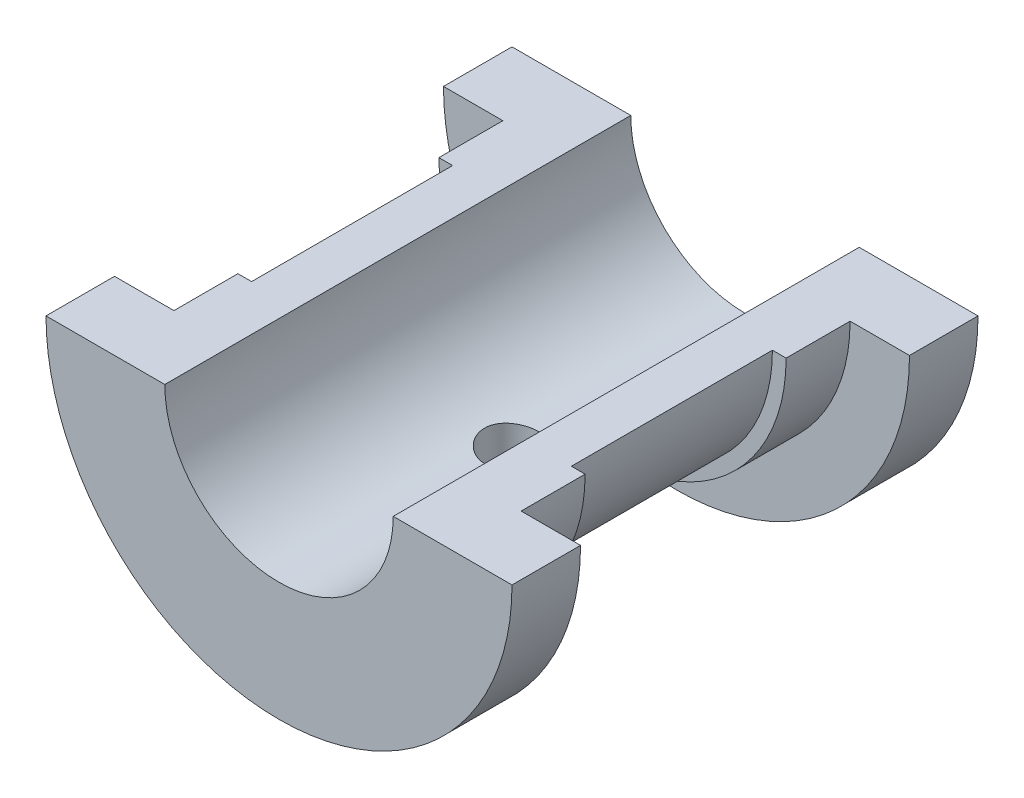
ISO-10303-21;
HEADER;
FILE_DESCRIPTION(('STEP AP214'),'2;1');
FILE_NAME('part.step','',(''),(''),'','','');
FILE_SCHEMA(('AUTOMOTIVE_DESIGN { 1 0 10303 214 1 1 1 1 }'));
ENDSEC;
DATA;
#1=APPLICATION_CONTEXT('core data for automotive mechanical design processes');
#2=APPLICATION_PROTOCOL_DEFINITION('international standard','automotive_design',2000,#1);
#3=PRODUCT_CONTEXT('',#1,'mechanical');
#4=PRODUCT('Part','Part','',(#3));
#5=PRODUCT_RELATED_PRODUCT_CATEGORY('part','',(#4));
#6=PRODUCT_DEFINITION_FORMATION('','',#4);
#7=PRODUCT_DEFINITION_CONTEXT('part definition',#1,'design');
#8=PRODUCT_DEFINITION('design','',#6,#7);
#9=PRODUCT_DEFINITION_SHAPE('','',#8);
#10=(LENGTH_UNIT() NAMED_UNIT(*) SI_UNIT(.MILLI.,.METRE.));
#11=(NAMED_UNIT(*) PLANE_ANGLE_UNIT() SI_UNIT($,.RADIAN.));
#12=(NAMED_UNIT(*) SI_UNIT($,.STERADIAN.) SOLID_ANGLE_UNIT());
#13=UNCERTAINTY_MEASURE_WITH_UNIT(LENGTH_MEASURE(1.E-05),#10,'distance_accuracy_value','');
#14=(GEOMETRIC_REPRESENTATION_CONTEXT(3) GLOBAL_UNCERTAINTY_ASSIGNED_CONTEXT((#13)) GLOBAL_UNIT_ASSIGNED_CONTEXT((#10,
#11,#12)) REPRESENTATION_CONTEXT('',''));
#15=CARTESIAN_POINT('',(0.,0.,0.));
#16=DIRECTION('',(0.,0.,1.));
#17=DIRECTION('',(1.,0.,0.));
#18=AXIS2_PLACEMENT_3D('',#15,#16,#17);
#19=CARTESIAN_POINT('',(25.5,1.78065548281E-13,-25.5));
#20=DIRECTION('',(0.,0.,-1.));
#21=DIRECTION('',(-1.,0.,0.));
#22=AXIS2_PLACEMENT_3D('',#19,#20,#21);
#23=PLANE('',#22);
#24=CARTESIAN_POINT('',(0.,0.,-25.5));
#25=DIRECTION('',(0.,0.,-1.));
#26=DIRECTION('',(-1.,0.,0.));
#27=AXIS2_PLACEMENT_3D('',#24,#25,#26);
#28=CIRCLE('',#27,12.5);
#29=CARTESIAN_POINT('',(12.5,0.,-25.5));
#30=VERTEX_POINT('',#29);
#31=CARTESIAN_POINT('',(-12.5,0.,-25.5));
#32=VERTEX_POINT('',#31);
#33=EDGE_CURVE('E46',#30,#32,#28,.T.);
#34=ORIENTED_EDGE('',*,*,#33,.F.);
#35=DIRECTION('',(1.,0.,0.));
#36=VECTOR('',#35,1.);
#37=CARTESIAN_POINT('',(25.5,1.78065548281E-13,-25.5));
#38=LINE('',#37,#36);
#39=CARTESIAN_POINT('',(25.5,1.78065548281E-13,-25.5));
#40=VERTEX_POINT('',#39);
#41=EDGE_CURVE('E129',#30,#40,#38,.T.);
#42=ORIENTED_EDGE('',*,*,#41,.T.);
#43=CARTESIAN_POINT('',(0.,0.,-25.5));
#44=DIRECTION('',(0.,0.,-1.));
#45=DIRECTION('',(-1.,0.,0.));
#46=AXIS2_PLACEMENT_3D('',#43,#44,#45);
#47=CIRCLE('',#46,25.5);
#48=CARTESIAN_POINT('',(-25.5,0.,-25.5));
#49=VERTEX_POINT('',#48);
#50=EDGE_CURVE('E124',#40,#49,#47,.T.);
#51=ORIENTED_EDGE('',*,*,#50,.T.);
#52=DIRECTION('',(-1.,0.,0.));
#53=VECTOR('',#52,1.);
#54=CARTESIAN_POINT('',(-25.5,0.,-25.5));
#55=LINE('',#54,#53);
#56=EDGE_CURVE('E127',#32,#49,#55,.T.);
#57=ORIENTED_EDGE('',*,*,#56,.F.);
#58=EDGE_LOOP('',(#34,#42,#51,#57));
#59=FACE_BOUND('',#58,.T.);
#60=ADVANCED_FACE('F33',(#59),#23,.T.);
#61=CARTESIAN_POINT('',(0.,0.,0.));
#62=DIRECTION('',(0.,0.,-1.));
#63=DIRECTION('',(-1.,0.,0.));
#64=AXIS2_PLACEMENT_3D('',#61,#62,#63);
#65=CYLINDRICAL_SURFACE('',#64,12.5);
#66=CARTESIAN_POINT('',(0.,-12.5,-3.));
#67=CARTESIAN_POINT('',(-0.165963929028716,-12.4999970714968,-2.99999497592273));
#68=CARTESIAN_POINT('',(-0.331985420928068,-12.4966615634859,-2.98618158976393));
#69=CARTESIAN_POINT('',(-0.65928429097138,-12.4836783946932,-2.93136726040462));
#70=CARTESIAN_POINT('',(-0.820558683214275,-12.4740268462166,-2.89034957200532));
#71=CARTESIAN_POINT('',(-1.13358839471402,-12.4494823208195,-2.78250766549564));
#72=CARTESIAN_POINT('',(-1.28535442324822,-12.4345953702841,-2.71571311014241));
#73=CARTESIAN_POINT('',(-1.57552517879763,-12.4011725442513,-2.55831456355411));
#74=CARTESIAN_POINT('',(-1.71392971475166,-12.3826366165873,-2.46771023192274));
#75=CARTESIAN_POINT('',(-1.97609263393972,-12.3435386014785,-2.26343582162447));
#76=CARTESIAN_POINT('',(-2.0995595210048,-12.322947245431,-2.14939721895074));
#77=CARTESIAN_POINT('',(-2.32581080811943,-12.2822574370147,-1.90228113093536));
#78=CARTESIAN_POINT('',(-2.42859304624489,-12.2621590363612,-1.76920165795905));
#79=CARTESIAN_POINT('',(-2.61189993555015,-12.224437969062,-1.48555416698254));
#80=CARTESIAN_POINT('',(-2.69210377047565,-12.2068525815312,-1.33477341624115));
#81=CARTESIAN_POINT('',(-2.82591582947333,-12.1765733412448,-1.02138016487152));
#82=CARTESIAN_POINT('',(-2.87952794169564,-12.1638787734309,-0.858769397976844));
#83=CARTESIAN_POINT('',(-2.95765058108663,-12.1451184675007,-0.529523426731097));
#84=CARTESIAN_POINT('',(-2.98268262400616,-12.1389341034343,-0.363018878474493));
#85=CARTESIAN_POINT('',(-3.00455808879087,-12.1335389605945,-0.0280676203572424));
#86=CARTESIAN_POINT('',(-3.00140571682399,-12.1343271412568,0.140378795956922));
#87=CARTESIAN_POINT('',(-2.96741912081942,-12.1426811387007,0.470475966012881));
#88=CARTESIAN_POINT('',(-2.93720103400494,-12.1500960921292,0.632194565189556));
#89=CARTESIAN_POINT('',(-2.85092141637189,-12.1706283738785,0.948197316647835));
#90=CARTESIAN_POINT('',(-2.79485817372027,-12.1837460799133,1.10248097573443));
#91=CARTESIAN_POINT('',(-2.65794121231782,-12.2143476734445,1.40091297808436));
#92=CARTESIAN_POINT('',(-2.5768594824696,-12.2318714325758,1.54495245291669));
#93=CARTESIAN_POINT('',(-2.39236688956383,-12.2692875046196,1.81760450072258));
#94=CARTESIAN_POINT('',(-2.28895240342647,-12.2891802016137,1.94621456528511));
#95=CARTESIAN_POINT('',(-2.05951493908847,-12.329732025739,2.18789357031874));
#96=CARTESIAN_POINT('',(-1.93297064389908,-12.3503975788014,2.30046709906221));
#97=CARTESIAN_POINT('',(-1.66255592459691,-12.3896951594929,2.50288471974638));
#98=CARTESIAN_POINT('',(-1.51868504982141,-12.4083271342048,2.59272822029261));
#99=CARTESIAN_POINT('',(-1.21702847718581,-12.4415394956921,2.74729722061278));
#100=CARTESIAN_POINT('',(-1.05920278696054,-12.4561077058019,2.81194745623779));
#101=CARTESIAN_POINT('',(-0.734497606078676,-12.4794620474154,2.91366507904859));
#102=CARTESIAN_POINT('',(-0.567619713387662,-12.4882491958651,2.95073731762681));
#103=CARTESIAN_POINT('',(-0.233787399651665,-12.4989027542708,2.99550206465204));
#104=CARTESIAN_POINT('',(-0.0669284805450078,-12.5009282130753,3.00386989246157));
#105=CARTESIAN_POINT('',(0.265804381586629,-12.4982807419474,2.9928332331491));
#106=CARTESIAN_POINT('',(0.431678404764952,-12.4936083648176,2.97343103801277));
#107=CARTESIAN_POINT('',(0.755422580108847,-12.4781916395217,2.90796302148362));
#108=CARTESIAN_POINT('',(0.913370579311303,-12.4675301590363,2.8622608904262));
#109=CARTESIAN_POINT('',(1.21935330013476,-12.4413335015664,2.74590180830474));
#110=CARTESIAN_POINT('',(1.3673870666415,-12.4257978558334,2.6752424570219));
#111=CARTESIAN_POINT('',(1.6520615099557,-12.3911910149582,2.50963340640215));
#112=CARTESIAN_POINT('',(1.78847176740355,-12.3720653178033,2.41429928307563));
#113=CARTESIAN_POINT('',(2.04359904096632,-12.3324936406987,2.20254307098659));
#114=CARTESIAN_POINT('',(2.16231325074336,-12.3120474520734,2.08611764391922));
#115=CARTESIAN_POINT('',(2.38142453789941,-12.271574214277,1.83235916879145));
#116=CARTESIAN_POINT('',(2.4813497404737,-12.2515669262668,1.6946148779179));
#117=CARTESIAN_POINT('',(2.65666020824081,-12.2147538797452,1.40390957210327));
#118=CARTESIAN_POINT('',(2.7320465722335,-12.1979479778962,1.25094923890653));
#119=CARTESIAN_POINT('',(2.85558993518171,-12.1696189519335,0.934987486456012));
#120=CARTESIAN_POINT('',(2.90390754385905,-12.1580647463107,0.772051796578773));
#121=CARTESIAN_POINT('',(2.97238380283979,-12.1415072663683,0.440053814979307));
#122=CARTESIAN_POINT('',(2.99254804274991,-12.1365026916888,0.270992746238226));
#123=CARTESIAN_POINT('',(3.00387066449353,-12.1337046220624,-0.0636707002805993));
#124=CARTESIAN_POINT('',(2.99578106592266,-12.1357241633848,-0.229246496326695));
#125=CARTESIAN_POINT('',(2.95253345626267,-12.1463176460425,-0.556599764223693));
#126=CARTESIAN_POINT('',(2.91737590900096,-12.1548914750658,-0.718377301111356));
#127=CARTESIAN_POINT('',(2.82138591303537,-12.1775274976747,-1.03279755254825));
#128=CARTESIAN_POINT('',(2.76068402045612,-12.191561756094,-1.18548227258375));
#129=CARTESIAN_POINT('',(2.61543373580582,-12.2235433612686,-1.47860441388369));
#130=CARTESIAN_POINT('',(2.53088229934855,-12.2414912075257,-1.61904026858636));
#131=CARTESIAN_POINT('',(2.33793007708464,-12.279819325529,-1.88733700011951));
#132=CARTESIAN_POINT('',(2.22900267979018,-12.3002478697532,-2.01481232309873));
#133=CARTESIAN_POINT('',(1.99143074773236,-12.3409359831145,-2.24991998805192));
#134=CARTESIAN_POINT('',(1.86278158874234,-12.361195511444,-2.35754766321024));
#135=CARTESIAN_POINT('',(1.5868829988014,-12.3996570299581,-2.55160925955475));
#136=CARTESIAN_POINT('',(1.43936414359402,-12.4178200201219,-2.637668405442));
#137=CARTESIAN_POINT('',(1.13153622828567,-12.4496380610582,-2.78362953274789));
#138=CARTESIAN_POINT('',(0.971236973691222,-12.4632965272855,-2.84355134339162));
#139=CARTESIAN_POINT('',(0.675887025694767,-12.4824059901497,-2.92603862513779));
#140=CARTESIAN_POINT('',(0.542312066268424,-12.4889599449579,-2.9537166157857));
#141=CARTESIAN_POINT('',(0.272504227478251,-12.4977580149525,-2.99069878085188));
#142=CARTESIAN_POINT('',(0.136271517915778,-12.5000024045682,-3.00000412522552));
#143=CARTESIAN_POINT('',(0.,-12.5,-3.));
#144=B_SPLINE_CURVE_WITH_KNOTS('',3,(#66,#67,#68,#69,#70,#71,#72,#73,#74,#75,#76,#77,#78,#79,
#80,#81,#82,#83,#84,#85,#86,#87,#88,#89,#90,#91,#92,#93,#94,#95,#96,#97,#98,#99,#100,#101,#102,
#103,#104,#105,#106,#107,#108,#109,#110,#111,#112,#113,#114,#115,#116,#117,#118,#119,#120,#121,
#122,#123,#124,#125,#126,#127,#128,#129,#130,#131,#132,#133,#134,#135,#136,#137,#138,#139,#140,
#141,#142,#143),.UNSPECIFIED.,.T.,.F.,(4,2,2,2,2,2,2,2,2,2,2,2,2,2,2,2,2,2,2,2,2,2,2,2,2,2,2,2,
2,2,2,2,2,2,2,2,2,2,4),(0.,0.497392599366678,0.995091645758824,1.49221966408501,
1.98935478998519,2.49500570148357,3.00070943533306,3.51327262050849,4.02576083835037,
4.52873995359111,5.03164400680465,5.52338274964838,6.01515406709138,6.51154667521171,
7.00801987450003,7.51749958381934,8.0269925475217,8.53799614678203,9.04890983140415,
9.54771776810825,10.0464845383097,10.5385143736981,11.0305915421211,11.5308523313794,
12.031192370573,12.5427824523192,13.0543496229377,13.5628484119093,14.0712462285018,
14.5662165454702,15.0611783809799,15.5536406351284,16.0461657803879,16.5505844610431,
17.0551215958269,17.5678974206352,18.0802835459069,18.4887142303991,18.897118905514),.UNSPECIFIED.);
#145=CARTESIAN_POINT('',(0.,-12.5,-3.));
#146=VERTEX_POINT('',#145);
#147=EDGE_CURVE('E148',#146,#146,#144,.T.);
#148=ORIENTED_EDGE('',*,*,#147,.F.);
#149=EDGE_LOOP('',(#148));
#150=FACE_BOUND('',#149,.T.);
#151=CARTESIAN_POINT('',(0.,0.,25.5));
#152=DIRECTION('',(0.,0.,-1.));
#153=DIRECTION('',(-1.,0.,0.));
#154=AXIS2_PLACEMENT_3D('',#151,#152,#153);
#155=CIRCLE('',#154,12.5);
#156=CARTESIAN_POINT('',(12.5,0.,25.5));
#157=VERTEX_POINT('',#156);
#158=CARTESIAN_POINT('',(-12.5,0.,25.5));
#159=VERTEX_POINT('',#158);
#160=EDGE_CURVE('E59',#157,#159,#155,.T.);
#161=ORIENTED_EDGE('',*,*,#160,.F.);
#162=DIRECTION('',(0.,0.,-1.));
#163=VECTOR('',#162,1.);
#164=CARTESIAN_POINT('',(12.5,0.,-25.5));
#165=LINE('',#164,#163);
#166=EDGE_CURVE('E134',#157,#30,#165,.T.);
#167=ORIENTED_EDGE('',*,*,#166,.T.);
#168=ORIENTED_EDGE('',*,*,#33,.T.);
#169=DIRECTION('',(0.,0.,-1.));
#170=VECTOR('',#169,1.);
#171=CARTESIAN_POINT('',(-12.5,0.,-25.5));
#172=LINE('',#171,#170);
#173=EDGE_CURVE('E147',#159,#32,#172,.T.);
#174=ORIENTED_EDGE('',*,*,#173,.F.);
#175=EDGE_LOOP('',(#161,#167,#168,#174));
#176=FACE_BOUND('',#175,.T.);
#177=ADVANCED_FACE('F35',(#150,#176),#65,.F.);
#178=CARTESIAN_POINT('',(25.5,1.78065548281E-13,25.5));
#179=DIRECTION('',(0.,0.,1.));
#180=DIRECTION('',(1.,0.,0.));
#181=AXIS2_PLACEMENT_3D('',#178,#179,#180);
#182=PLANE('',#181);
#183=CARTESIAN_POINT('',(0.,0.,25.5));
#184=DIRECTION('',(0.,0.,-1.));
#185=DIRECTION('',(-1.,0.,0.));
#186=AXIS2_PLACEMENT_3D('',#183,#184,#185);
#187=CIRCLE('',#186,25.5);
#188=CARTESIAN_POINT('',(25.5,1.78065548281E-13,25.5));
#189=VERTEX_POINT('',#188);
#190=CARTESIAN_POINT('',(-25.5,0.,25.5));
#191=VERTEX_POINT('',#190);
#192=EDGE_CURVE('E225',#189,#191,#187,.T.);
#193=ORIENTED_EDGE('',*,*,#192,.F.);
#194=DIRECTION('',(-1.,0.,0.));
#195=VECTOR('',#194,1.);
#196=CARTESIAN_POINT('',(25.5,1.78065548281E-13,25.5));
#197=LINE('',#196,#195);
#198=EDGE_CURVE('E207',#189,#157,#197,.T.);
#199=ORIENTED_EDGE('',*,*,#198,.T.);
#200=ORIENTED_EDGE('',*,*,#160,.T.);
#201=DIRECTION('',(1.,0.,0.));
#202=VECTOR('',#201,1.);
#203=CARTESIAN_POINT('',(-25.5,0.,25.5));
#204=LINE('',#203,#202);
#205=EDGE_CURVE('E177',#191,#159,#204,.T.);
#206=ORIENTED_EDGE('',*,*,#205,.F.);
#207=EDGE_LOOP('',(#193,#199,#200,#206));
#208=FACE_BOUND('',#207,.T.);
#209=ADVANCED_FACE('F264',(#208),#182,.T.);
#210=CARTESIAN_POINT('',(0.,0.,0.));
#211=DIRECTION('',(0.,0.,-1.));
#212=DIRECTION('',(-1.,0.,0.));
#213=AXIS2_PLACEMENT_3D('',#210,#211,#212);
#214=CYLINDRICAL_SURFACE('',#213,25.5);
#215=CARTESIAN_POINT('',(0.,0.,18.));
#216=DIRECTION('',(0.,0.,-1.));
#217=DIRECTION('',(-1.,0.,0.));
#218=AXIS2_PLACEMENT_3D('',#215,#216,#217);
#219=CIRCLE('',#218,25.5);
#220=CARTESIAN_POINT('',(25.5,1.78065548281E-13,18.));
#221=VERTEX_POINT('',#220);
#222=CARTESIAN_POINT('',(-25.5,0.,18.));
#223=VERTEX_POINT('',#222);
#224=EDGE_CURVE('E223',#221,#223,#219,.T.);
#225=ORIENTED_EDGE('',*,*,#224,.F.);
#226=DIRECTION('',(0.,0.,1.));
#227=VECTOR('',#226,1.);
#228=CARTESIAN_POINT('',(25.5,1.78065548281E-13,25.5));
#229=LINE('',#228,#227);
#230=EDGE_CURVE('E204',#221,#189,#229,.T.);
#231=ORIENTED_EDGE('',*,*,#230,.T.);
#232=ORIENTED_EDGE('',*,*,#192,.T.);
#233=DIRECTION('',(0.,0.,1.));
#234=VECTOR('',#233,1.);
#235=CARTESIAN_POINT('',(-25.5,0.,25.5));
#236=LINE('',#235,#234);
#237=EDGE_CURVE('E174',#223,#191,#236,.T.);
#238=ORIENTED_EDGE('',*,*,#237,.F.);
#239=EDGE_LOOP('',(#225,#231,#232,#238));
#240=FACE_BOUND('',#239,.T.);
#241=ADVANCED_FACE('F262',(#240),#214,.T.);
#242=CARTESIAN_POINT('',(25.5,1.78065548281E-13,18.));
#243=DIRECTION('',(0.,0.,-1.));
#244=DIRECTION('',(-1.,0.,0.));
#245=AXIS2_PLACEMENT_3D('',#242,#243,#244);
#246=PLANE('',#245);
#247=CARTESIAN_POINT('',(0.,0.,18.));
#248=DIRECTION('',(0.,0.,-1.));
#249=DIRECTION('',(-1.,0.,0.));
#250=AXIS2_PLACEMENT_3D('',#247,#248,#249);
#251=CIRCLE('',#250,19.);
#252=CARTESIAN_POINT('',(19.,1.32676290876039E-13,18.));
#253=VERTEX_POINT('',#252);
#254=CARTESIAN_POINT('',(-19.,0.,18.));
#255=VERTEX_POINT('',#254);
#256=EDGE_CURVE('E221',#253,#255,#251,.T.);
#257=ORIENTED_EDGE('',*,*,#256,.F.);
#258=DIRECTION('',(1.,0.,0.));
#259=VECTOR('',#258,1.);
#260=CARTESIAN_POINT('',(25.5,1.78065548281E-13,18.));
#261=LINE('',#260,#259);
#262=EDGE_CURVE('E201',#253,#221,#261,.T.);
#263=ORIENTED_EDGE('',*,*,#262,.T.);
#264=ORIENTED_EDGE('',*,*,#224,.T.);
#265=DIRECTION('',(-1.,0.,0.));
#266=VECTOR('',#265,1.);
#267=CARTESIAN_POINT('',(-25.5,0.,18.));
#268=LINE('',#267,#266);
#269=EDGE_CURVE('E171',#255,#223,#268,.T.);
#270=ORIENTED_EDGE('',*,*,#269,.F.);
#271=EDGE_LOOP('',(#257,#263,#264,#270));
#272=FACE_BOUND('',#271,.T.);
#273=ADVANCED_FACE('F257',(#272),#246,.T.);
#274=CARTESIAN_POINT('',(0.,0.,0.));
#275=DIRECTION('',(0.,0.,-1.));
#276=DIRECTION('',(-1.,0.,0.));
#277=AXIS2_PLACEMENT_3D('',#274,#275,#276);
#278=CYLINDRICAL_SURFACE('',#277,19.);
#279=CARTESIAN_POINT('',(0.,0.,11.));
#280=DIRECTION('',(0.,0.,-1.));
#281=DIRECTION('',(-1.,0.,0.));
#282=AXIS2_PLACEMENT_3D('',#279,#280,#281);
#283=CIRCLE('',#282,19.);
#284=CARTESIAN_POINT('',(19.,1.32676290876039E-13,11.));
#285=VERTEX_POINT('',#284);
#286=CARTESIAN_POINT('',(-19.,0.,11.));
#287=VERTEX_POINT('',#286);
#288=EDGE_CURVE('E219',#285,#287,#283,.T.);
#289=ORIENTED_EDGE('',*,*,#288,.F.);
#290=DIRECTION('',(0.,0.,1.));
#291=VECTOR('',#290,1.);
#292=CARTESIAN_POINT('',(19.,1.32676290876039E-13,18.));
#293=LINE('',#292,#291);
#294=EDGE_CURVE('E198',#285,#253,#293,.T.);
#295=ORIENTED_EDGE('',*,*,#294,.T.);
#296=ORIENTED_EDGE('',*,*,#256,.T.);
#297=DIRECTION('',(0.,0.,1.));
#298=VECTOR('',#297,1.);
#299=CARTESIAN_POINT('',(-19.,0.,18.));
#300=LINE('',#299,#298);
#301=EDGE_CURVE('E168',#287,#255,#300,.T.);
#302=ORIENTED_EDGE('',*,*,#301,.F.);
#303=EDGE_LOOP('',(#289,#295,#296,#302));
#304=FACE_BOUND('',#303,.T.);
#305=ADVANCED_FACE('F254',(#304),#278,.T.);
#306=CARTESIAN_POINT('',(19.,1.32676290876039E-13,11.));
#307=DIRECTION('',(0.,0.,-1.));
#308=DIRECTION('',(-1.,0.,0.));
#309=AXIS2_PLACEMENT_3D('',#306,#307,#308);
#310=PLANE('',#309);
#311=CARTESIAN_POINT('',(0.,0.,11.));
#312=DIRECTION('',(0.,0.,-1.));
#313=DIRECTION('',(-1.,0.,0.));
#314=AXIS2_PLACEMENT_3D('',#311,#312,#313);
#315=CIRCLE('',#314,17.5);
#316=CARTESIAN_POINT('',(17.5,1.2220184685951E-13,11.));
#317=VERTEX_POINT('',#316);
#318=CARTESIAN_POINT('',(-17.5,0.,11.));
#319=VERTEX_POINT('',#318);
#320=EDGE_CURVE('E217',#317,#319,#315,.T.);
#321=ORIENTED_EDGE('',*,*,#320,.F.);
#322=DIRECTION('',(1.,0.,0.));
#323=VECTOR('',#322,1.);
#324=CARTESIAN_POINT('',(19.,1.32676290876039E-13,11.));
#325=LINE('',#324,#323);
#326=EDGE_CURVE('E195',#317,#285,#325,.T.);
#327=ORIENTED_EDGE('',*,*,#326,.T.);
#328=ORIENTED_EDGE('',*,*,#288,.T.);
#329=DIRECTION('',(-1.,0.,0.));
#330=VECTOR('',#329,1.);
#331=CARTESIAN_POINT('',(-19.,0.,11.));
#332=LINE('',#331,#330);
#333=EDGE_CURVE('E165',#319,#287,#332,.T.);
#334=ORIENTED_EDGE('',*,*,#333,.F.);
#335=EDGE_LOOP('',(#321,#327,#328,#334));
#336=FACE_BOUND('',#335,.T.);
#337=ADVANCED_FACE('F249',(#336),#310,.T.);
#338=CARTESIAN_POINT('',(0.,0.,0.));
#339=DIRECTION('',(0.,0.,-1.));
#340=DIRECTION('',(-1.,0.,0.));
#341=AXIS2_PLACEMENT_3D('',#338,#339,#340);
#342=CYLINDRICAL_SURFACE('',#341,17.5);
#343=CARTESIAN_POINT('',(0.,-17.5,-3.));
#344=CARTESIAN_POINT('',(0.167197888477242,-17.4999970906633,-2.99999336002777));
#345=CARTESIAN_POINT('',(0.334485258143131,-17.4975789341583,-2.9859752108854));
#346=CARTESIAN_POINT('',(0.664363255770978,-17.4881653307871,-2.9302990995645));
#347=CARTESIAN_POINT('',(0.826949503842277,-17.4811657504724,-2.88861617722034));
#348=CARTESIAN_POINT('',(1.14260529013332,-17.4633739362553,-2.77891008604766));
#349=CARTESIAN_POINT('',(1.29568266742598,-17.4525848765595,-2.7109089574683));
#350=CARTESIAN_POINT('',(1.58823673724716,-17.4283986081642,-2.55055555976633));
#351=CARTESIAN_POINT('',(1.72771488279892,-17.4150016785645,-2.45820589610098));
#352=CARTESIAN_POINT('',(1.99053687981522,-17.3869322580543,-2.25078614716181));
#353=CARTESIAN_POINT('',(2.11372361591322,-17.3722493384791,-2.13551837087062));
#354=CARTESIAN_POINT('',(2.33910834882426,-17.3433420797551,-1.88595990137048));
#355=CARTESIAN_POINT('',(2.44130498247174,-17.3291177704403,-1.75166797362762));
#356=CARTESIAN_POINT('',(2.62244343427673,-17.3026372057527,-1.46678711062376));
#357=CARTESIAN_POINT('',(2.70122890432628,-17.2903944202576,-1.31609740156248));
#358=CARTESIAN_POINT('',(2.8323085511595,-17.2694082884627,-1.00337737292835));
#359=CARTESIAN_POINT('',(2.88460462423909,-17.2606646916761,-0.841347866082793));
#360=CARTESIAN_POINT('',(2.96072391561323,-17.2477710031912,-0.512216683497004));
#361=CARTESIAN_POINT('',(2.98481900474365,-17.243577079757,-0.34517963415869));
#362=CARTESIAN_POINT('',(3.00469550116558,-17.2401251006059,-0.00938486508187417));
#363=CARTESIAN_POINT('',(3.00047902833606,-17.2408666753347,0.159372724883305));
#364=CARTESIAN_POINT('',(2.9640733197104,-17.247161908727,0.491871139844601));
#365=CARTESIAN_POINT('',(2.93219030257035,-17.2526628874287,0.655646636178514));
#366=CARTESIAN_POINT('',(2.84183747786595,-17.2677745842643,0.975488916428065));
#367=CARTESIAN_POINT('',(2.78336671037819,-17.2773854507809,1.13155542179294));
#368=CARTESIAN_POINT('',(2.64119011069865,-17.2996905267923,1.43246174324675));
#369=CARTESIAN_POINT('',(2.55735789103785,-17.3124001155707,1.57724065502486));
#370=CARTESIAN_POINT('',(2.36692773155713,-17.3394600238194,1.85079247024585));
#371=CARTESIAN_POINT('',(2.26032785038531,-17.3538104831548,1.97956400729042));
#372=CARTESIAN_POINT('',(2.02572372299599,-17.3827662542506,2.21921755595085));
#373=CARTESIAN_POINT('',(1.89745691927206,-17.397372438932,2.32984259754192));
#374=CARTESIAN_POINT('',(1.62404588495938,-17.4250200407509,2.52803945123166));
#375=CARTESIAN_POINT('',(1.47890153361697,-17.4380614466915,2.61561109837572));
#376=CARTESIAN_POINT('',(1.17560813403869,-17.4611302114515,2.76524184909041));
#377=CARTESIAN_POINT('',(1.01744722776392,-17.4711547823576,2.82727737360573));
#378=CARTESIAN_POINT('',(0.692740844795708,-17.4870382024854,2.9238318026769));
#379=CARTESIAN_POINT('',(0.526196112090002,-17.4928974206486,2.95835314430384));
#380=CARTESIAN_POINT('',(0.191663620946768,-17.4997401167391,2.99854888489858));
#381=CARTESIAN_POINT('',(0.0237194081687687,-17.5007831904569,3.00457589999581));
#382=CARTESIAN_POINT('',(-0.310778590563214,-17.4980396044024,2.98855325145464));
#383=CARTESIAN_POINT('',(-0.477332432950726,-17.4942531416242,2.96650473300188));
#384=CARTESIAN_POINT('',(-0.803226267811299,-17.4823128742762,2.8952501678744));
#385=CARTESIAN_POINT('',(-0.962605737440312,-17.474187289333,2.84621953805802));
#386=CARTESIAN_POINT('',(-1.27088253097933,-17.4544761572207,2.72258016702585));
#387=CARTESIAN_POINT('',(-1.41977923763672,-17.4428904065181,2.64796992113086));
#388=CARTESIAN_POINT('',(-1.70438969290455,-17.417396034143,2.47448758312578));
#389=CARTESIAN_POINT('',(-1.83996793782045,-17.4034668086373,2.37539627431762));
#390=CARTESIAN_POINT('',(-2.09269752640408,-17.374890575826,2.15606511767561));
#391=CARTESIAN_POINT('',(-2.20984744764914,-17.3602435132271,2.0358236388444));
#392=CARTESIAN_POINT('',(-2.42370922919042,-17.3316886120672,1.77602051143289));
#393=CARTESIAN_POINT('',(-2.52018230406535,-17.3177906676551,1.63626104120146));
#394=CARTESIAN_POINT('',(-2.68828177195729,-17.2924954044816,1.34231277339394));
#395=CARTESIAN_POINT('',(-2.75990898496466,-17.2810980031992,1.1881244522279));
#396=CARTESIAN_POINT('',(-2.87593039066209,-17.2621692769636,0.870349519704498));
#397=CARTESIAN_POINT('',(-2.92044137511779,-17.2546213950509,0.706806580821888));
#398=CARTESIAN_POINT('',(-2.98133287310577,-17.2442055530579,0.374424534192305));
#399=CARTESIAN_POINT('',(-2.99771598859209,-17.2413371601052,0.20558591779071));
#400=CARTESIAN_POINT('',(-3.00181092557774,-17.2406244562008,-0.130208811389111));
#401=CARTESIAN_POINT('',(-2.98989876393497,-17.2427142552452,-0.297160317320669));
#402=CARTESIAN_POINT('',(-2.93855658141656,-17.2515376902196,-0.62664551627573));
#403=CARTESIAN_POINT('',(-2.89912666495964,-17.2582713085282,-0.789179226060546));
#404=CARTESIAN_POINT('',(-2.79401555437729,-17.2755980335454,-1.10505721850843));
#405=CARTESIAN_POINT('',(-2.72836856938937,-17.2861861092089,-1.25841317801404));
#406=CARTESIAN_POINT('',(-2.57272591738777,-17.3100332980519,-1.55199555431466));
#407=CARTESIAN_POINT('',(-2.4827289285662,-17.323292556223,-1.6922212577946));
#408=CARTESIAN_POINT('',(-2.27960652854412,-17.3511960758331,-1.95745891026577));
#409=CARTESIAN_POINT('',(-2.16620511263839,-17.3658556265499,-2.08225791456266));
#410=CARTESIAN_POINT('',(-1.92007371238759,-17.3947877125717,-2.31118326116821));
#411=CARTESIAN_POINT('',(-1.78733928025448,-17.4090601579197,-2.41530483332687));
#412=CARTESIAN_POINT('',(-1.50514767837312,-17.4357318551825,-2.6006229221308));
#413=CARTESIAN_POINT('',(-1.35557476659935,-17.4481165680147,-2.68164531379999));
#414=CARTESIAN_POINT('',(-1.0447868677741,-17.4694759066054,-2.81728768360264));
#415=CARTESIAN_POINT('',(-0.88358351302067,-17.4784538848809,-2.8719336328885));
#416=CARTESIAN_POINT('',(-0.601487930679761,-17.4900568902174,-2.94157686709655));
#417=CARTESIAN_POINT('',(-0.482290496810162,-17.4937653830011,-2.96344994889187));
#418=CARTESIAN_POINT('',(-0.242077656560215,-17.4987379681287,-2.99266378225941));
#419=CARTESIAN_POINT('',(-0.121062284493385,-17.5000021065514,-3.00000480777727));
#420=CARTESIAN_POINT('',(0.,-17.5,-3.));
#421=B_SPLINE_CURVE_WITH_KNOTS('',3,(#343,#344,#345,#346,#347,#348,#349,#350,#351,#352,#353,
#354,#355,#356,#357,#358,#359,#360,#361,#362,#363,#364,#365,#366,#367,#368,#369,#370,#371,#372,
#373,#374,#375,#376,#377,#378,#379,#380,#381,#382,#383,#384,#385,#386,#387,#388,#389,#390,#391,
#392,#393,#394,#395,#396,#397,#398,#399,#400,#401,#402,#403,#404,#405,#406,#407,#408,#409,#410,
#411,#412,#413,#414,#415,#416,#417,#418,#419,#420),.UNSPECIFIED.,.T.,.F.,(4,2,2,2,2,2,2,2,2,2,2,
2,2,2,2,2,2,2,2,2,2,2,2,2,2,2,2,2,2,2,2,2,2,2,2,2,2,2,4),(0.,0.501151101757202,1.00275497607122,
1.50393968673033,2.00507078900043,2.5107284354123,3.01641891050083,3.52541434956454,
4.03437334603057,4.53838423155781,5.04235737878726,5.54082259089734,6.03930580101093,
6.54031528278254,7.04136750167458,7.54899572691696,8.05662758430693,8.56472712329613,
9.07278165232261,9.57453227491966,10.076262432039,10.5747686152101,11.0733041272271,
11.5764767729204,12.0796882378443,12.5884304724088,13.0971559153069,13.6036744532888,
14.1101461335088,14.6099250273454,15.1097020247342,15.6088290116353,16.1079830984257,
16.6133996019155,17.1189325666264,17.6281812174477,18.1369274164456,18.4998006653088,
18.8626670735372),.UNSPECIFIED.);
#422=CARTESIAN_POINT('',(0.,-17.5,-3.));
#423=VERTEX_POINT('',#422);
#424=EDGE_CURVE('E11',#423,#423,#421,.T.);
#425=ORIENTED_EDGE('',*,*,#424,.F.);
#426=EDGE_LOOP('',(#425));
#427=FACE_BOUND('',#426,.T.);
#428=CARTESIAN_POINT('',(0.,0.,-11.));
#429=DIRECTION('',(0.,0.,-1.));
#430=DIRECTION('',(-1.,0.,0.));
#431=AXIS2_PLACEMENT_3D('',#428,#429,#430);
#432=CIRCLE('',#431,17.5);
#433=CARTESIAN_POINT('',(17.5,1.2220184685951E-13,-11.));
#434=VERTEX_POINT('',#433);
#435=CARTESIAN_POINT('',(-17.5,0.,-11.));
#436=VERTEX_POINT('',#435);
#437=EDGE_CURVE('E215',#434,#436,#432,.T.);
#438=ORIENTED_EDGE('',*,*,#437,.F.);
#439=DIRECTION('',(0.,0.,1.));
#440=VECTOR('',#439,1.);
#441=CARTESIAN_POINT('',(17.5,1.2220184685951E-13,-11.));
#442=LINE('',#441,#440);
#443=EDGE_CURVE('E192',#434,#317,#442,.T.);
#444=ORIENTED_EDGE('',*,*,#443,.T.);
#445=ORIENTED_EDGE('',*,*,#320,.T.);
#446=DIRECTION('',(0.,0.,1.));
#447=VECTOR('',#446,1.);
#448=CARTESIAN_POINT('',(-17.5,0.,-11.));
#449=LINE('',#448,#447);
#450=EDGE_CURVE('E162',#436,#319,#449,.T.);
#451=ORIENTED_EDGE('',*,*,#450,.F.);
#452=EDGE_LOOP('',(#438,#444,#445,#451));
#453=FACE_BOUND('',#452,.T.);
#454=ADVANCED_FACE('F246',(#427,#453),#342,.T.);
#455=CARTESIAN_POINT('',(19.,1.32676290876039E-13,-11.));
#456=DIRECTION('',(0.,0.,1.));
#457=DIRECTION('',(1.,0.,0.));
#458=AXIS2_PLACEMENT_3D('',#455,#456,#457);
#459=PLANE('',#458);
#460=CARTESIAN_POINT('',(0.,0.,-11.));
#461=DIRECTION('',(0.,0.,-1.));
#462=DIRECTION('',(-1.,0.,0.));
#463=AXIS2_PLACEMENT_3D('',#460,#461,#462);
#464=CIRCLE('',#463,19.);
#465=CARTESIAN_POINT('',(19.,1.32676290876039E-13,-11.));
#466=VERTEX_POINT('',#465);
#467=CARTESIAN_POINT('',(-19.,0.,-11.));
#468=VERTEX_POINT('',#467);
#469=EDGE_CURVE('E213',#466,#468,#464,.T.);
#470=ORIENTED_EDGE('',*,*,#469,.F.);
#471=DIRECTION('',(-1.,0.,0.));
#472=VECTOR('',#471,1.);
#473=CARTESIAN_POINT('',(19.,1.32676290876039E-13,-11.));
#474=LINE('',#473,#472);
#475=EDGE_CURVE('E189',#466,#434,#474,.T.);
#476=ORIENTED_EDGE('',*,*,#475,.T.);
#477=ORIENTED_EDGE('',*,*,#437,.T.);
#478=DIRECTION('',(1.,0.,0.));
#479=VECTOR('',#478,1.);
#480=CARTESIAN_POINT('',(-19.,0.,-11.));
#481=LINE('',#480,#479);
#482=EDGE_CURVE('E159',#468,#436,#481,.T.);
#483=ORIENTED_EDGE('',*,*,#482,.F.);
#484=EDGE_LOOP('',(#470,#476,#477,#483));
#485=FACE_BOUND('',#484,.T.);
#486=ADVANCED_FACE('F241',(#485),#459,.T.);
#487=CARTESIAN_POINT('',(0.,0.,0.));
#488=DIRECTION('',(0.,0.,-1.));
#489=DIRECTION('',(-1.,0.,0.));
#490=AXIS2_PLACEMENT_3D('',#487,#488,#489);
#491=CYLINDRICAL_SURFACE('',#490,19.);
#492=CARTESIAN_POINT('',(0.,0.,-18.));
#493=DIRECTION('',(0.,0.,-1.));
#494=DIRECTION('',(-1.,0.,0.));
#495=AXIS2_PLACEMENT_3D('',#492,#493,#494);
#496=CIRCLE('',#495,19.);
#497=CARTESIAN_POINT('',(19.,1.32676290876039E-13,-18.));
#498=VERTEX_POINT('',#497);
#499=CARTESIAN_POINT('',(-19.,0.,-18.));
#500=VERTEX_POINT('',#499);
#501=EDGE_CURVE('E211',#498,#500,#496,.T.);
#502=ORIENTED_EDGE('',*,*,#501,.F.);
#503=DIRECTION('',(0.,0.,1.));
#504=VECTOR('',#503,1.);
#505=CARTESIAN_POINT('',(19.,1.32676290876039E-13,-18.));
#506=LINE('',#505,#504);
#507=EDGE_CURVE('E186',#498,#466,#506,.T.);
#508=ORIENTED_EDGE('',*,*,#507,.T.);
#509=ORIENTED_EDGE('',*,*,#469,.T.);
#510=DIRECTION('',(0.,0.,1.));
#511=VECTOR('',#510,1.);
#512=CARTESIAN_POINT('',(-19.,0.,-18.));
#513=LINE('',#512,#511);
#514=EDGE_CURVE('E156',#500,#468,#513,.T.);
#515=ORIENTED_EDGE('',*,*,#514,.F.);
#516=EDGE_LOOP('',(#502,#508,#509,#515));
#517=FACE_BOUND('',#516,.T.);
#518=ADVANCED_FACE('F239',(#517),#491,.T.);
#519=CARTESIAN_POINT('',(25.5,1.78065548281E-13,-18.));
#520=DIRECTION('',(0.,0.,1.));
#521=DIRECTION('',(1.,0.,0.));
#522=AXIS2_PLACEMENT_3D('',#519,#520,#521);
#523=PLANE('',#522);
#524=CARTESIAN_POINT('',(0.,0.,-18.));
#525=DIRECTION('',(0.,0.,-1.));
#526=DIRECTION('',(-1.,0.,0.));
#527=AXIS2_PLACEMENT_3D('',#524,#525,#526);
#528=CIRCLE('',#527,25.5);
#529=CARTESIAN_POINT('',(25.5,1.78065548281E-13,-18.));
#530=VERTEX_POINT('',#529);
#531=CARTESIAN_POINT('',(-25.5,0.,-18.));
#532=VERTEX_POINT('',#531);
#533=EDGE_CURVE('E133',#530,#532,#528,.T.);
#534=ORIENTED_EDGE('',*,*,#533,.F.);
#535=DIRECTION('',(-1.,0.,0.));
#536=VECTOR('',#535,1.);
#537=CARTESIAN_POINT('',(25.5,1.78065548281E-13,-18.));
#538=LINE('',#537,#536);
#539=EDGE_CURVE('E183',#530,#498,#538,.T.);
#540=ORIENTED_EDGE('',*,*,#539,.T.);
#541=ORIENTED_EDGE('',*,*,#501,.T.);
#542=DIRECTION('',(1.,0.,0.));
#543=VECTOR('',#542,1.);
#544=CARTESIAN_POINT('',(-25.5,0.,-18.));
#545=LINE('',#544,#543);
#546=EDGE_CURVE('E142',#532,#500,#545,.T.);
#547=ORIENTED_EDGE('',*,*,#546,.F.);
#548=EDGE_LOOP('',(#534,#540,#541,#547));
#549=FACE_BOUND('',#548,.T.);
#550=ADVANCED_FACE('F235',(#549),#523,.T.);
#551=CARTESIAN_POINT('',(0.,0.,0.));
#552=DIRECTION('',(0.,0.,-1.));
#553=DIRECTION('',(-1.,0.,0.));
#554=AXIS2_PLACEMENT_3D('',#551,#552,#553);
#555=CYLINDRICAL_SURFACE('',#554,25.5);
#556=DIRECTION('',(0.,0.,1.));
#557=VECTOR('',#556,1.);
#558=CARTESIAN_POINT('',(25.5,1.78065548281E-13,-25.5));
#559=LINE('',#558,#557);
#560=EDGE_CURVE('E181',#40,#530,#559,.T.);
#561=ORIENTED_EDGE('',*,*,#560,.T.);
#562=ORIENTED_EDGE('',*,*,#533,.T.);
#563=DIRECTION('',(0.,0.,1.));
#564=VECTOR('',#563,1.);
#565=CARTESIAN_POINT('',(-25.5,0.,-25.5));
#566=LINE('',#565,#564);
#567=EDGE_CURVE('E137',#49,#532,#566,.T.);
#568=ORIENTED_EDGE('',*,*,#567,.F.);
#569=ORIENTED_EDGE('',*,*,#50,.F.);
#570=EDGE_LOOP('',(#561,#562,#568,#569));
#571=FACE_BOUND('',#570,.T.);
#572=ADVANCED_FACE('F138',(#571),#555,.T.);
#573=CARTESIAN_POINT('',(0.,0.,0.));
#574=DIRECTION('',(0.,1.,0.));
#575=DIRECTION('',(0.,0.,-1.));
#576=AXIS2_PLACEMENT_3D('',#573,#574,#575);
#577=PLANE('',#576);
#578=ORIENTED_EDGE('',*,*,#41,.F.);
#579=ORIENTED_EDGE('',*,*,#166,.F.);
#580=ORIENTED_EDGE('',*,*,#198,.F.);
#581=ORIENTED_EDGE('',*,*,#230,.F.);
#582=ORIENTED_EDGE('',*,*,#262,.F.);
#583=ORIENTED_EDGE('',*,*,#294,.F.);
#584=ORIENTED_EDGE('',*,*,#326,.F.);
#585=ORIENTED_EDGE('',*,*,#443,.F.);
#586=ORIENTED_EDGE('',*,*,#475,.F.);
#587=ORIENTED_EDGE('',*,*,#507,.F.);
#588=ORIENTED_EDGE('',*,*,#539,.F.);
#589=ORIENTED_EDGE('',*,*,#560,.F.);
#590=EDGE_LOOP('',(#578,#579,#580,#581,#582,#583,#584,#585,#586,#587,#588,#589));
#591=FACE_BOUND('',#590,.T.);
#592=ADVANCED_FACE('F230',(#591),#577,.T.);
#593=CARTESIAN_POINT('',(0.,0.,0.));
#594=DIRECTION('',(0.,-1.,0.));
#595=DIRECTION('',(0.,0.,-1.));
#596=AXIS2_PLACEMENT_3D('',#593,#594,#595);
#597=PLANE('',#596);
#598=ORIENTED_EDGE('',*,*,#56,.T.);
#599=ORIENTED_EDGE('',*,*,#567,.T.);
#600=ORIENTED_EDGE('',*,*,#546,.T.);
#601=ORIENTED_EDGE('',*,*,#514,.T.);
#602=ORIENTED_EDGE('',*,*,#482,.T.);
#603=ORIENTED_EDGE('',*,*,#450,.T.);
#604=ORIENTED_EDGE('',*,*,#333,.T.);
#605=ORIENTED_EDGE('',*,*,#301,.T.);
#606=ORIENTED_EDGE('',*,*,#269,.T.);
#607=ORIENTED_EDGE('',*,*,#237,.T.);
#608=ORIENTED_EDGE('',*,*,#205,.T.);
#609=ORIENTED_EDGE('',*,*,#173,.T.);
#610=EDGE_LOOP('',(#598,#599,#600,#601,#602,#603,#604,#605,#606,#607,#608,#609));
#611=FACE_BOUND('',#610,.T.);
#612=ADVANCED_FACE('F145',(#611),#597,.F.);
#613=CARTESIAN_POINT('',(0.,1.76941794549634E-13,0.));
#614=DIRECTION('',(0.,-1.,0.));
#615=DIRECTION('',(0.,0.,-1.));
#616=AXIS2_PLACEMENT_3D('',#613,#614,#615);
#617=CYLINDRICAL_SURFACE('',#616,3.);
#618=ORIENTED_EDGE('',*,*,#147,.T.);
#619=EDGE_LOOP('',(#618));
#620=FACE_BOUND('',#619,.T.);
#621=ORIENTED_EDGE('',*,*,#424,.T.);
#622=EDGE_LOOP('',(#621));
#623=FACE_BOUND('',#622,.T.);
#624=ADVANCED_FACE('F340',(#620,#623),#617,.F.);
#625=CLOSED_SHELL('',(#60,#177,#209,#241,#273,#305,#337,#454,#486,#518,#550,#572,#592,#612,#624));
#626=MANIFOLD_SOLID_BREP('B2',#625);
#627=ADVANCED_BREP_SHAPE_REPRESENTATION('',(#18,#626),#14);
#628=SHAPE_DEFINITION_REPRESENTATION(#9,#627);
ENDSEC;
END-ISO-10303-21;
